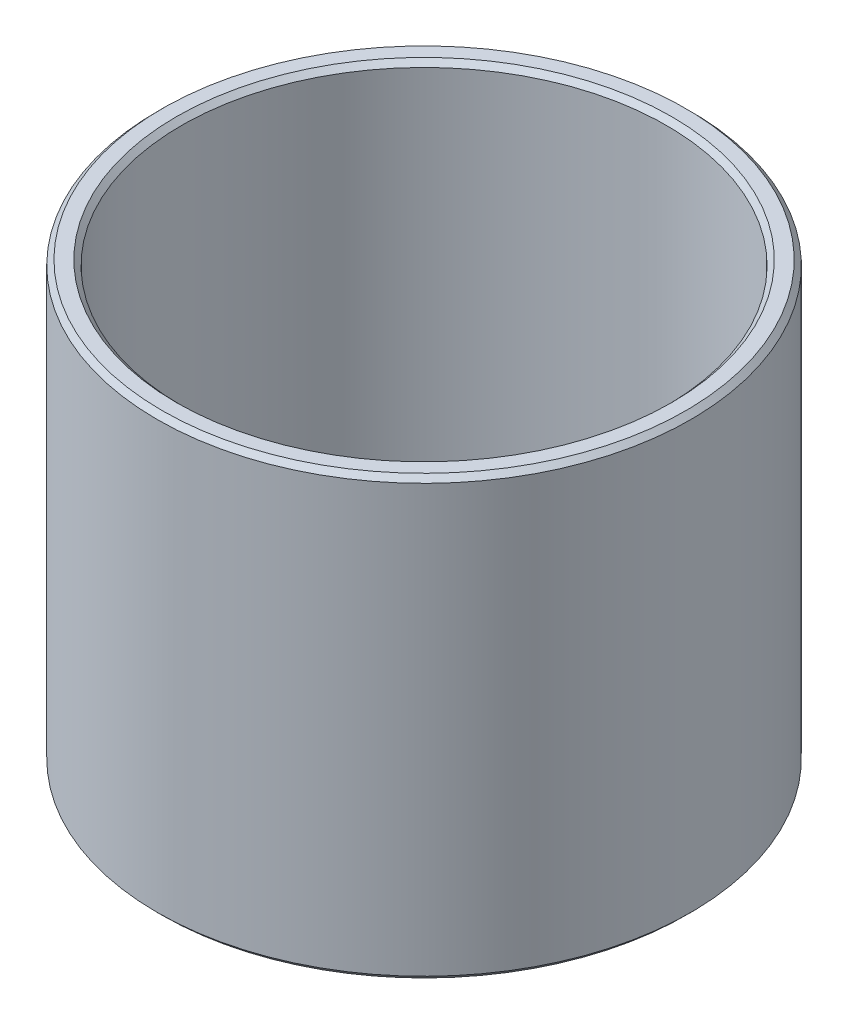
ISO-10303-21;
HEADER;
FILE_DESCRIPTION(('STEP AP214'),'2;1');
FILE_NAME('part.step','',(''),(''),'','','');
FILE_SCHEMA(('AUTOMOTIVE_DESIGN { 1 0 10303 214 1 1 1 1 }'));
ENDSEC;
DATA;
#1=APPLICATION_CONTEXT('core data for automotive mechanical design processes');
#2=APPLICATION_PROTOCOL_DEFINITION('international standard','automotive_design',2000,#1);
#3=PRODUCT_CONTEXT('',#1,'mechanical');
#4=PRODUCT('Part','Part','',(#3));
#5=PRODUCT_RELATED_PRODUCT_CATEGORY('part','',(#4));
#6=PRODUCT_DEFINITION_FORMATION('','',#4);
#7=PRODUCT_DEFINITION_CONTEXT('part definition',#1,'design');
#8=PRODUCT_DEFINITION('design','',#6,#7);
#9=PRODUCT_DEFINITION_SHAPE('','',#8);
#10=(LENGTH_UNIT() NAMED_UNIT(*) SI_UNIT(.MILLI.,.METRE.));
#11=(NAMED_UNIT(*) PLANE_ANGLE_UNIT() SI_UNIT($,.RADIAN.));
#12=(NAMED_UNIT(*) SI_UNIT($,.STERADIAN.) SOLID_ANGLE_UNIT());
#13=UNCERTAINTY_MEASURE_WITH_UNIT(LENGTH_MEASURE(1.E-05),#10,'distance_accuracy_value','');
#14=(GEOMETRIC_REPRESENTATION_CONTEXT(3) GLOBAL_UNCERTAINTY_ASSIGNED_CONTEXT((#13)) GLOBAL_UNIT_ASSIGNED_CONTEXT((#10,
#11,#12)) REPRESENTATION_CONTEXT('',''));
#15=CARTESIAN_POINT('',(0.,0.,0.));
#16=DIRECTION('',(0.,0.,1.));
#17=DIRECTION('',(1.,0.,0.));
#18=AXIS2_PLACEMENT_3D('',#15,#16,#17);
#19=CARTESIAN_POINT('',(0.,77.8093314004018,0.));
#20=DIRECTION('',(0.,-1.,0.));
#21=DIRECTION('',(0.,0.,-1.));
#22=AXIS2_PLACEMENT_3D('',#19,#20,#21);
#23=CYLINDRICAL_SURFACE('',#22,47.5);
#24=CARTESIAN_POINT('',(0.,0.907020564541491,0.));
#25=DIRECTION('',(0.,1.,0.));
#26=DIRECTION('',(0.,0.,1.));
#27=AXIS2_PLACEMENT_3D('',#24,#25,#26);
#28=CIRCLE('',#27,47.5);
#29=CARTESIAN_POINT('',(0.,0.907020564541491,47.5));
#30=VERTEX_POINT('',#29);
#31=EDGE_CURVE('E10',#30,#30,#28,.T.);
#32=ORIENTED_EDGE('',*,*,#31,.T.);
#33=EDGE_LOOP('',(#32));
#34=FACE_BOUND('',#33,.T.);
#35=CARTESIAN_POINT('',(0.,76.9023108358603,0.));
#36=DIRECTION('',(0.,1.,0.));
#37=DIRECTION('',(0.,0.,1.));
#38=AXIS2_PLACEMENT_3D('',#35,#36,#37);
#39=CIRCLE('',#38,47.5);
#40=CARTESIAN_POINT('',(0.,76.9023108358603,47.5));
#41=VERTEX_POINT('',#40);
#42=EDGE_CURVE('E50',#41,#41,#39,.F.);
#43=ORIENTED_EDGE('',*,*,#42,.T.);
#44=EDGE_LOOP('',(#43));
#45=FACE_BOUND('',#44,.T.);
#46=ADVANCED_FACE('F39',(#34,#45),#23,.T.);
#47=CARTESIAN_POINT('',(0.,77.8093314004018,0.));
#48=DIRECTION('',(0.,1.,0.));
#49=DIRECTION('',(0.,0.,1.));
#50=AXIS2_PLACEMENT_3D('',#47,#48,#49);
#51=PLANE('',#50);
#52=CARTESIAN_POINT('',(0.,77.8093314004018,0.));
#53=DIRECTION('',(0.,1.,0.));
#54=DIRECTION('',(0.,0.,1.));
#55=AXIS2_PLACEMENT_3D('',#52,#53,#54);
#56=CIRCLE('',#55,44.0912947860612);
#57=CARTESIAN_POINT('',(0.,77.8093314004018,44.0912947860612));
#58=VERTEX_POINT('',#57);
#59=EDGE_CURVE('E58',#58,#58,#56,.F.);
#60=ORIENTED_EDGE('',*,*,#59,.T.);
#61=EDGE_LOOP('',(#60));
#62=FACE_BOUND('',#61,.T.);
#63=CARTESIAN_POINT('',(0.,77.8093314004018,0.));
#64=DIRECTION('',(0.,1.,0.));
#65=DIRECTION('',(0.,0.,1.));
#66=AXIS2_PLACEMENT_3D('',#63,#64,#65);
#67=CIRCLE('',#66,46.5929794354585);
#68=CARTESIAN_POINT('',(0.,77.8093314004018,46.5929794354585));
#69=VERTEX_POINT('',#68);
#70=EDGE_CURVE('E61',#69,#69,#67,.T.);
#71=ORIENTED_EDGE('',*,*,#70,.T.);
#72=EDGE_LOOP('',(#71));
#73=FACE_BOUND('',#72,.T.);
#74=ADVANCED_FACE('F88',(#62,#73),#51,.T.);
#75=CARTESIAN_POINT('',(0.,0.,0.));
#76=DIRECTION('',(0.,1.,0.));
#77=DIRECTION('',(0.,0.,1.));
#78=AXIS2_PLACEMENT_3D('',#75,#76,#77);
#79=PLANE('',#78);
#80=CARTESIAN_POINT('',(0.,0.,0.));
#81=DIRECTION('',(0.,1.,0.));
#82=DIRECTION('',(0.,0.,1.));
#83=AXIS2_PLACEMENT_3D('',#80,#81,#82);
#84=CIRCLE('',#83,44.0912947860612);
#85=CARTESIAN_POINT('',(0.,0.,44.0912947860612));
#86=VERTEX_POINT('',#85);
#87=EDGE_CURVE('E51',#86,#86,#84,.T.);
#88=ORIENTED_EDGE('',*,*,#87,.T.);
#89=EDGE_LOOP('',(#88));
#90=FACE_BOUND('',#89,.T.);
#91=CARTESIAN_POINT('',(0.,0.,0.));
#92=DIRECTION('',(0.,1.,0.));
#93=DIRECTION('',(0.,0.,1.));
#94=AXIS2_PLACEMENT_3D('',#91,#92,#93);
#95=CIRCLE('',#94,46.5929794354585);
#96=CARTESIAN_POINT('',(0.,0.,46.5929794354585));
#97=VERTEX_POINT('',#96);
#98=EDGE_CURVE('E54',#97,#97,#95,.F.);
#99=ORIENTED_EDGE('',*,*,#98,.T.);
#100=EDGE_LOOP('',(#99));
#101=FACE_BOUND('',#100,.T.);
#102=ADVANCED_FACE('F83',(#90,#101),#79,.F.);
#103=CARTESIAN_POINT('',(0.,77.8093314004018,0.));
#104=DIRECTION('',(0.,-1.,0.));
#105=DIRECTION('',(0.,0.,-1.));
#106=AXIS2_PLACEMENT_3D('',#103,#104,#105);
#107=CYLINDRICAL_SURFACE('',#106,43.1842742215197);
#108=CARTESIAN_POINT('',(0.,76.9023108358604,0.));
#109=DIRECTION('',(0.,1.,0.));
#110=DIRECTION('',(0.,0.,1.));
#111=AXIS2_PLACEMENT_3D('',#108,#109,#110);
#112=CIRCLE('',#111,43.1842742215197);
#113=CARTESIAN_POINT('',(0.,76.9023108358604,43.1842742215197));
#114=VERTEX_POINT('',#113);
#115=EDGE_CURVE('E67',#114,#114,#112,.T.);
#116=ORIENTED_EDGE('',*,*,#115,.T.);
#117=EDGE_LOOP('',(#116));
#118=FACE_BOUND('',#117,.T.);
#119=CARTESIAN_POINT('',(0.,0.907020564541519,0.));
#120=DIRECTION('',(0.,1.,0.));
#121=DIRECTION('',(0.,0.,1.));
#122=AXIS2_PLACEMENT_3D('',#119,#120,#121);
#123=CIRCLE('',#122,43.1842742215197);
#124=CARTESIAN_POINT('',(0.,0.907020564541519,43.1842742215197));
#125=VERTEX_POINT('',#124);
#126=EDGE_CURVE('E69',#125,#125,#123,.F.);
#127=ORIENTED_EDGE('',*,*,#126,.T.);
#128=EDGE_LOOP('',(#127));
#129=FACE_BOUND('',#128,.T.);
#130=ADVANCED_FACE('F71',(#118,#129),#107,.F.);
#131=CARTESIAN_POINT('',(0.,76.9023108358604,0.));
#132=DIRECTION('',(0.,1.,0.));
#133=DIRECTION('',(0.,0.,1.));
#134=AXIS2_PLACEMENT_3D('',#131,#132,#133);
#135=CONICAL_SURFACE('',#134,43.1842742215197,0.785398163397448);
#136=ORIENTED_EDGE('',*,*,#59,.F.);
#137=EDGE_LOOP('',(#136));
#138=FACE_BOUND('',#137,.T.);
#139=ORIENTED_EDGE('',*,*,#115,.F.);
#140=EDGE_LOOP('',(#139));
#141=FACE_BOUND('',#140,.T.);
#142=ADVANCED_FACE('F77',(#138,#141),#135,.F.);
#143=CARTESIAN_POINT('',(0.,0.,0.));
#144=DIRECTION('',(0.,-1.,0.));
#145=DIRECTION('',(0.,0.,-1.));
#146=AXIS2_PLACEMENT_3D('',#143,#144,#145);
#147=CONICAL_SURFACE('',#146,44.0912947860612,0.785398163397448);
#148=ORIENTED_EDGE('',*,*,#126,.F.);
#149=EDGE_LOOP('',(#148));
#150=FACE_BOUND('',#149,.T.);
#151=ORIENTED_EDGE('',*,*,#87,.F.);
#152=EDGE_LOOP('',(#151));
#153=FACE_BOUND('',#152,.T.);
#154=ADVANCED_FACE('F73',(#150,#153),#147,.F.);
#155=CARTESIAN_POINT('',(0.,0.907020564541491,0.));
#156=DIRECTION('',(0.,1.,0.));
#157=DIRECTION('',(0.,0.,1.));
#158=AXIS2_PLACEMENT_3D('',#155,#156,#157);
#159=CONICAL_SURFACE('',#158,47.5,0.78539816339746);
#160=CARTESIAN_POINT('',(0.,0.,46.5929794354585));
#161=CARTESIAN_POINT('',(0.,0.00944813088063853,46.6024275663391));
#162=CARTESIAN_POINT('',(0.,0.0188962617612797,46.6118756972198));
#163=CARTESIAN_POINT('',(0.,0.0377925235225621,46.6307719589811));
#164=CARTESIAN_POINT('',(0.,0.0472406544032033,46.6402200898617));
#165=CARTESIAN_POINT('',(0.,0.066136916164484,46.659116351623));
#166=CARTESIAN_POINT('',(0.,0.0755850470451235,46.6685644825036));
#167=CARTESIAN_POINT('',(0.,0.0944813088064047,46.6874607442649));
#168=CARTESIAN_POINT('',(0.,0.103929439687046,46.6969088751455));
#169=CARTESIAN_POINT('',(0.,0.122825701448327,46.7158051369068));
#170=CARTESIAN_POINT('',(0.,0.132273832328967,46.7252532677875));
#171=CARTESIAN_POINT('',(0.,0.151170094090248,46.7441495295487));
#172=CARTESIAN_POINT('',(0.,0.16061822497089,46.7535976604294));
#173=CARTESIAN_POINT('',(0.,0.179514486732171,46.7724939221907));
#174=CARTESIAN_POINT('',(0.,0.18896261761281,46.7819420530713));
#175=CARTESIAN_POINT('',(0.,0.207858879374091,46.8008383148326));
#176=CARTESIAN_POINT('',(0.,0.217307010254733,46.8102864457132));
#177=CARTESIAN_POINT('',(0.,0.236203272016014,46.8291827074745));
#178=CARTESIAN_POINT('',(0.,0.245651402896653,46.8386308383552));
#179=CARTESIAN_POINT('',(0.,0.264547664657934,46.8575271001164));
#180=CARTESIAN_POINT('',(0.,0.273995795538576,46.8669752309971));
#181=CARTESIAN_POINT('',(0.,0.292892057299857,46.8858714927584));
#182=CARTESIAN_POINT('',(0.,0.302340188180496,46.895319623639));
#183=CARTESIAN_POINT('',(0.,0.321236449941778,46.9142158854003));
#184=CARTESIAN_POINT('',(0.,0.330684580822419,46.9236640162809));
#185=CARTESIAN_POINT('',(0.,0.3495808425837,46.9425602780422));
#186=CARTESIAN_POINT('',(0.,0.35902897346434,46.9520084089228));
#187=CARTESIAN_POINT('',(0.,0.377925235225621,46.9709046706841));
#188=CARTESIAN_POINT('',(0.,0.387373366106262,46.9803528015648));
#189=CARTESIAN_POINT('',(0.,0.406269627867544,46.999249063326));
#190=CARTESIAN_POINT('',(0.,0.415717758748183,47.0086971942067));
#191=CARTESIAN_POINT('',(0.,0.434614020509464,47.027593455968));
#192=CARTESIAN_POINT('',(0.,0.444062151390105,47.0370415868486));
#193=CARTESIAN_POINT('',(0.,0.462958413151387,47.0559378486099));
#194=CARTESIAN_POINT('',(0.,0.472406544032027,47.0653859794905));
#195=CARTESIAN_POINT('',(0.,0.491302805793307,47.0842822412518));
#196=CARTESIAN_POINT('',(0.,0.500750936673948,47.0937303721325));
#197=CARTESIAN_POINT('',(0.,0.519647198435229,47.1126266338937));
#198=CARTESIAN_POINT('',(0.,0.529095329315871,47.1220747647744));
#199=CARTESIAN_POINT('',(0.,0.547991591077152,47.1409710265357));
#200=CARTESIAN_POINT('',(0.,0.557439721957791,47.1504191574163));
#201=CARTESIAN_POINT('',(0.,0.576335983719072,47.1693154191776));
#202=CARTESIAN_POINT('',(0.,0.585784114599714,47.1787635500582));
#203=CARTESIAN_POINT('',(0.,0.604680376360995,47.1976598118195));
#204=CARTESIAN_POINT('',(0.,0.614128507241634,47.2071079427001));
#205=CARTESIAN_POINT('',(0.,0.633024769002915,47.2260042044614));
#206=CARTESIAN_POINT('',(0.,0.642472899883557,47.2354523353421));
#207=CARTESIAN_POINT('',(0.,0.661369161644838,47.2543485971033));
#208=CARTESIAN_POINT('',(0.,0.670817292525478,47.263796727984));
#209=CARTESIAN_POINT('',(0.,0.689713554286759,47.2826929897453));
#210=CARTESIAN_POINT('',(0.,0.6991616851674,47.2921411206259));
#211=CARTESIAN_POINT('',(0.,0.718057946928681,47.3110373823872));
#212=CARTESIAN_POINT('',(0.,0.727506077809321,47.3204855132678));
#213=CARTESIAN_POINT('',(0.,0.746402339570602,47.3393817750291));
#214=CARTESIAN_POINT('',(0.,0.755850470451243,47.3488299059098));
#215=CARTESIAN_POINT('',(0.,0.774746732212524,47.367726167671));
#216=CARTESIAN_POINT('',(0.,0.784194863093164,47.3771742985517));
#217=CARTESIAN_POINT('',(0.,0.803091124854445,47.396070560313));
#218=CARTESIAN_POINT('',(0.,0.812539255735087,47.4055186911936));
#219=CARTESIAN_POINT('',(0.,0.831435517496368,47.4244149529549));
#220=CARTESIAN_POINT('',(0.,0.840883648377007,47.4338630838355));
#221=CARTESIAN_POINT('',(0.,0.859779910138288,47.4527593455968));
#222=CARTESIAN_POINT('',(0.,0.869228041018929,47.4622074764774));
#223=CARTESIAN_POINT('',(0.,0.888124302780211,47.4811037382387));
#224=CARTESIAN_POINT('',(0.,0.897572433660853,47.4905518691194));
#225=CARTESIAN_POINT('',(0.,0.907020564541491,47.5));
#226=B_SPLINE_CURVE_WITH_KNOTS('',3,(#160,#161,#162,#163,#164,#165,#166,#167,#168,#169,#170,
#171,#172,#173,#174,#175,#176,#177,#178,#179,#180,#181,#182,#183,#184,#185,#186,#187,#188,#189,
#190,#191,#192,#193,#194,#195,#196,#197,#198,#199,#200,#201,#202,#203,#204,#205,#206,#207,#208,
#209,#210,#211,#212,#213,#214,#215,#216,#217,#218,#219,#220,#221,#222,#223,#224,#225),
.UNSPECIFIED.,.F.,.F.,(4,2,2,2,2,2,2,2,2,2,2,2,2,2,2,2,2,2,2,2,2,2,2,2,2,2,2,2,2,2,2,2,4),(0.,
0.0400850244914365,0.080170048982868,0.120255073474304,0.160340097965736,0.200425122457173,
0.240510146948604,0.280595171440041,0.320680195931472,0.360765220422909,0.40085024491434,
0.440935269405777,0.481020293897208,0.521105318388645,0.561190342880076,0.601275367371513,
0.641360391862944,0.681445416354381,0.721530440845817,0.761615465337249,0.801700489828685,
0.841785514320117,0.881870538811553,0.921955563302985,0.962040587794421,1.00212561228585,
1.04221063677729,1.08229566126872,1.12238068576016,1.16246571025159,1.20255073474303,
1.24263575923446,1.28272078372589),.UNSPECIFIED.);
#227=EDGE_CURVE('BSEAM76',#97,#30,#226,.T.);
#228=ORIENTED_EDGE('',*,*,#98,.F.);
#229=ORIENTED_EDGE('',*,*,#31,.F.);
#230=ORIENTED_EDGE('',*,*,#227,.T.);
#231=ORIENTED_EDGE('',*,*,#227,.F.);
#232=EDGE_LOOP('',(#228,#230,#229,#231));
#233=FACE_BOUND('',#232,.T.);
#234=ADVANCED_FACE('F76',(#233),#159,.T.);
#235=CARTESIAN_POINT('',(0.,77.8093314004018,0.));
#236=DIRECTION('',(0.,-1.,0.));
#237=DIRECTION('',(0.,0.,-1.));
#238=AXIS2_PLACEMENT_3D('',#235,#236,#237);
#239=CONICAL_SURFACE('',#238,46.5929794354585,0.785398163397448);
#240=ORIENTED_EDGE('',*,*,#42,.F.);
#241=EDGE_LOOP('',(#240));
#242=FACE_BOUND('',#241,.T.);
#243=ORIENTED_EDGE('',*,*,#70,.F.);
#244=EDGE_LOOP('',(#243));
#245=FACE_BOUND('',#244,.T.);
#246=ADVANCED_FACE('F45',(#242,#245),#239,.T.);
#247=CLOSED_SHELL('',(#46,#74,#102,#130,#142,#154,#234,#246));
#248=MANIFOLD_SOLID_BREP('B2',#247);
#249=ADVANCED_BREP_SHAPE_REPRESENTATION('',(#18,#248),#14);
#250=SHAPE_DEFINITION_REPRESENTATION(#9,#249);
ENDSEC;
END-ISO-10303-21;
